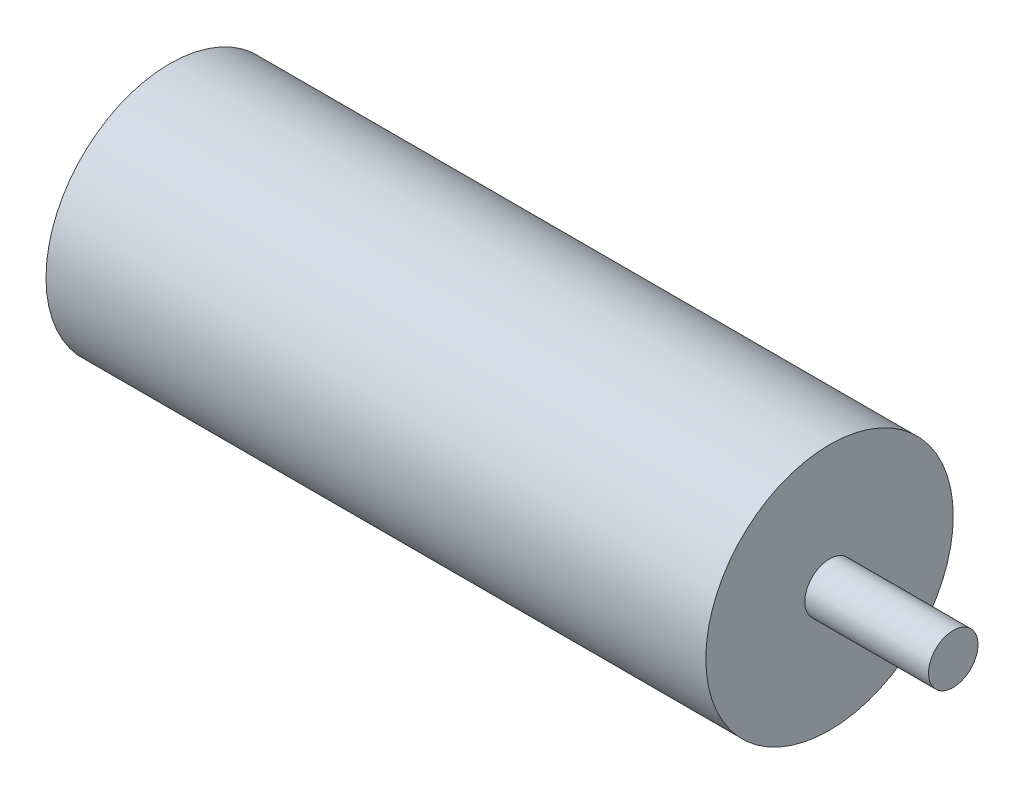
ISO-10303-21;
HEADER;
FILE_DESCRIPTION(('STEP AP214'),'2;1');
FILE_NAME('part.step','',(''),(''),'','','');
FILE_SCHEMA(('AUTOMOTIVE_DESIGN { 1 0 10303 214 1 1 1 1 }'));
ENDSEC;
DATA;
#1=APPLICATION_CONTEXT('core data for automotive mechanical design processes');
#2=APPLICATION_PROTOCOL_DEFINITION('international standard','automotive_design',2000,#1);
#3=PRODUCT_CONTEXT('',#1,'mechanical');
#4=PRODUCT('Part','Part','',(#3));
#5=PRODUCT_RELATED_PRODUCT_CATEGORY('part','',(#4));
#6=PRODUCT_DEFINITION_FORMATION('','',#4);
#7=PRODUCT_DEFINITION_CONTEXT('part definition',#1,'design');
#8=PRODUCT_DEFINITION('design','',#6,#7);
#9=PRODUCT_DEFINITION_SHAPE('','',#8);
#10=(LENGTH_UNIT() NAMED_UNIT(*) SI_UNIT(.MILLI.,.METRE.));
#11=(NAMED_UNIT(*) PLANE_ANGLE_UNIT() SI_UNIT($,.RADIAN.));
#12=(NAMED_UNIT(*) SI_UNIT($,.STERADIAN.) SOLID_ANGLE_UNIT());
#13=UNCERTAINTY_MEASURE_WITH_UNIT(LENGTH_MEASURE(1.E-05),#10,'distance_accuracy_value','');
#14=(GEOMETRIC_REPRESENTATION_CONTEXT(3) GLOBAL_UNCERTAINTY_ASSIGNED_CONTEXT((#13)) GLOBAL_UNIT_ASSIGNED_CONTEXT((#10,
#11,#12)) REPRESENTATION_CONTEXT('',''));
#15=CARTESIAN_POINT('',(0.,0.,0.));
#16=DIRECTION('',(0.,0.,1.));
#17=DIRECTION('',(1.,0.,0.));
#18=AXIS2_PLACEMENT_3D('',#15,#16,#17);
#19=CARTESIAN_POINT('',(60.,20.0994365209795,35.8177268345798));
#20=DIRECTION('',(-1.,0.,0.));
#21=DIRECTION('',(0.,0.,1.));
#22=AXIS2_PLACEMENT_3D('',#19,#20,#21);
#23=CYLINDRICAL_SURFACE('',#22,1.5);
#24=CARTESIAN_POINT('',(45.,20.0994365209795,35.8177268345798));
#25=DIRECTION('',(1.,0.,0.));
#26=DIRECTION('',(0.,0.,-1.));
#27=AXIS2_PLACEMENT_3D('',#24,#25,#26);
#28=CIRCLE('',#27,1.5);
#29=CARTESIAN_POINT('',(45.,20.0994365209795,34.3177268345798));
#30=VERTEX_POINT('',#29);
#31=EDGE_CURVE('E40',#30,#30,#28,.T.);
#32=ORIENTED_EDGE('',*,*,#31,.T.);
#33=EDGE_LOOP('',(#32));
#34=FACE_BOUND('',#33,.T.);
#35=CARTESIAN_POINT('',(52.5,20.0994365209795,35.8177268345798));
#36=DIRECTION('',(1.,0.,0.));
#37=DIRECTION('',(0.,0.,-1.));
#38=AXIS2_PLACEMENT_3D('',#35,#36,#37);
#39=CIRCLE('',#38,1.5);
#40=CARTESIAN_POINT('',(52.5,20.0994365209795,34.3177268345798));
#41=VERTEX_POINT('',#40);
#42=EDGE_CURVE('E36',#41,#41,#39,.T.);
#43=ORIENTED_EDGE('',*,*,#42,.F.);
#44=EDGE_LOOP('',(#43));
#45=FACE_BOUND('',#44,.T.);
#46=ADVANCED_FACE('F32',(#34,#45),#23,.T.);
#47=CARTESIAN_POINT('',(45.,20.0994365209795,35.8177268345798));
#48=DIRECTION('',(-1.,0.,0.));
#49=DIRECTION('',(0.,0.,1.));
#50=AXIS2_PLACEMENT_3D('',#47,#48,#49);
#51=CYLINDRICAL_SURFACE('',#50,7.5);
#52=CARTESIAN_POINT('',(45.,20.0994365209795,35.8177268345798));
#53=DIRECTION('',(1.,0.,0.));
#54=DIRECTION('',(0.,0.,-1.));
#55=AXIS2_PLACEMENT_3D('',#52,#53,#54);
#56=CIRCLE('',#55,7.5);
#57=CARTESIAN_POINT('',(45.,20.0994365209795,28.3177268345798));
#58=VERTEX_POINT('',#57);
#59=EDGE_CURVE('E10',#58,#58,#56,.T.);
#60=ORIENTED_EDGE('',*,*,#59,.F.);
#61=EDGE_LOOP('',(#60));
#62=FACE_BOUND('',#61,.T.);
#63=CARTESIAN_POINT('',(5.,20.0994365209795,35.8177268345798));
#64=DIRECTION('',(-1.,0.,0.));
#65=DIRECTION('',(0.,0.,1.));
#66=AXIS2_PLACEMENT_3D('',#63,#64,#65);
#67=CIRCLE('',#66,7.5);
#68=CARTESIAN_POINT('',(5.,20.0994365209795,43.3177268345798));
#69=VERTEX_POINT('',#68);
#70=EDGE_CURVE('E45',#69,#69,#67,.T.);
#71=ORIENTED_EDGE('',*,*,#70,.F.);
#72=EDGE_LOOP('',(#71));
#73=FACE_BOUND('',#72,.T.);
#74=ADVANCED_FACE('F34',(#62,#73),#51,.T.);
#75=CARTESIAN_POINT('',(45.,20.0994365209795,35.8177268345798));
#76=DIRECTION('',(1.,0.,0.));
#77=DIRECTION('',(0.,0.,-1.));
#78=AXIS2_PLACEMENT_3D('',#75,#76,#77);
#79=PLANE('',#78);
#80=ORIENTED_EDGE('',*,*,#59,.T.);
#81=EDGE_LOOP('',(#80));
#82=FACE_BOUND('',#81,.T.);
#83=ORIENTED_EDGE('',*,*,#31,.F.);
#84=EDGE_LOOP('',(#83));
#85=FACE_BOUND('',#84,.T.);
#86=ADVANCED_FACE('F61',(#82,#85),#79,.T.);
#87=CARTESIAN_POINT('',(5.,19.4737671114353,35.946372140728));
#88=DIRECTION('',(-1.,0.,0.));
#89=DIRECTION('',(0.,0.,1.));
#90=AXIS2_PLACEMENT_3D('',#87,#88,#89);
#91=PLANE('',#90);
#92=ORIENTED_EDGE('',*,*,#70,.T.);
#93=EDGE_LOOP('',(#92));
#94=FACE_BOUND('',#93,.T.);
#95=ADVANCED_FACE('F64',(#94),#91,.T.);
#96=CARTESIAN_POINT('',(52.5,20.1075233903083,35.8445881687146));
#97=DIRECTION('',(1.,0.,0.));
#98=DIRECTION('',(0.,0.,-1.));
#99=AXIS2_PLACEMENT_3D('',#96,#97,#98);
#100=PLANE('',#99);
#101=ORIENTED_EDGE('',*,*,#42,.T.);
#102=EDGE_LOOP('',(#101));
#103=FACE_BOUND('',#102,.T.);
#104=ADVANCED_FACE('F53',(#103),#100,.T.);
#105=CLOSED_SHELL('',(#46,#74,#86,#95,#104));
#106=MANIFOLD_SOLID_BREP('B2',#105);
#107=ADVANCED_BREP_SHAPE_REPRESENTATION('',(#18,#106),#14);
#108=SHAPE_DEFINITION_REPRESENTATION(#9,#107);
ENDSEC;
END-ISO-10303-21;
